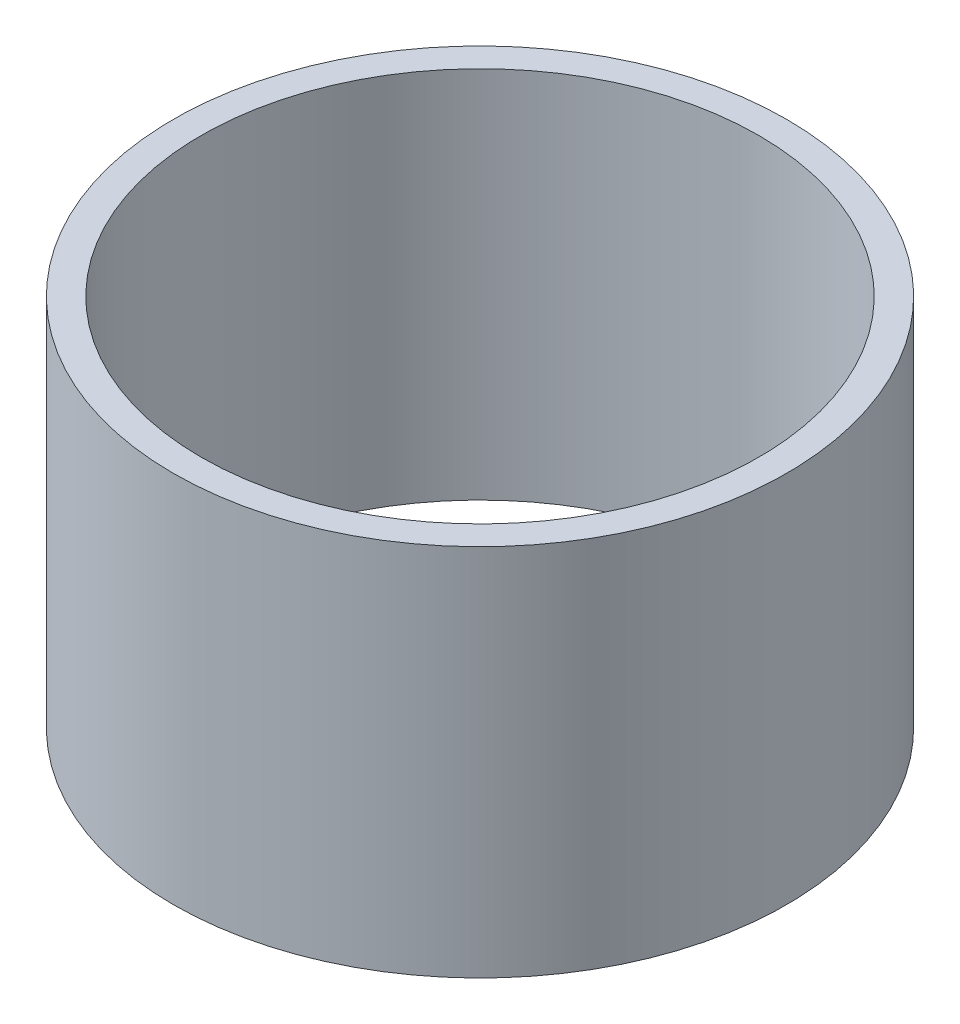
ISO-10303-21;
HEADER;
FILE_DESCRIPTION(('STEP AP214'),'2;1');
FILE_NAME('part.step','',(''),(''),'','','');
FILE_SCHEMA(('AUTOMOTIVE_DESIGN { 1 0 10303 214 1 1 1 1 }'));
ENDSEC;
DATA;
#1=APPLICATION_CONTEXT('core data for automotive mechanical design processes');
#2=APPLICATION_PROTOCOL_DEFINITION('international standard','automotive_design',2000,#1);
#3=PRODUCT_CONTEXT('',#1,'mechanical');
#4=PRODUCT('Part','Part','',(#3));
#5=PRODUCT_RELATED_PRODUCT_CATEGORY('part','',(#4));
#6=PRODUCT_DEFINITION_FORMATION('','',#4);
#7=PRODUCT_DEFINITION_CONTEXT('part definition',#1,'design');
#8=PRODUCT_DEFINITION('design','',#6,#7);
#9=PRODUCT_DEFINITION_SHAPE('','',#8);
#10=(LENGTH_UNIT() NAMED_UNIT(*) SI_UNIT(.MILLI.,.METRE.));
#11=(NAMED_UNIT(*) PLANE_ANGLE_UNIT() SI_UNIT($,.RADIAN.));
#12=(NAMED_UNIT(*) SI_UNIT($,.STERADIAN.) SOLID_ANGLE_UNIT());
#13=UNCERTAINTY_MEASURE_WITH_UNIT(LENGTH_MEASURE(1.E-05),#10,'distance_accuracy_value','');
#14=(GEOMETRIC_REPRESENTATION_CONTEXT(3) GLOBAL_UNCERTAINTY_ASSIGNED_CONTEXT((#13)) GLOBAL_UNIT_ASSIGNED_CONTEXT((#10,
#11,#12)) REPRESENTATION_CONTEXT('',''));
#15=CARTESIAN_POINT('',(0.,0.,0.));
#16=DIRECTION('',(0.,0.,1.));
#17=DIRECTION('',(1.,0.,0.));
#18=AXIS2_PLACEMENT_3D('',#15,#16,#17);
#19=CARTESIAN_POINT('',(0.,67.,0.));
#20=DIRECTION('',(0.,1.,0.));
#21=DIRECTION('',(0.,0.,1.));
#22=AXIS2_PLACEMENT_3D('',#19,#20,#21);
#23=PLANE('',#22);
#24=CARTESIAN_POINT('',(0.,67.,0.));
#25=DIRECTION('',(0.,1.,0.));
#26=DIRECTION('',(0.,0.,1.));
#27=AXIS2_PLACEMENT_3D('',#24,#25,#26);
#28=CIRCLE('',#27,55.);
#29=CARTESIAN_POINT('',(0.,67.,55.));
#30=VERTEX_POINT('',#29);
#31=EDGE_CURVE('E10',#30,#30,#28,.T.);
#32=ORIENTED_EDGE('',*,*,#31,.T.);
#33=EDGE_LOOP('',(#32));
#34=FACE_BOUND('',#33,.T.);
#35=CARTESIAN_POINT('',(0.,67.,0.));
#36=DIRECTION('',(0.,1.,0.));
#37=DIRECTION('',(0.,0.,1.));
#38=AXIS2_PLACEMENT_3D('',#35,#36,#37);
#39=CIRCLE('',#38,50.);
#40=CARTESIAN_POINT('',(0.,67.,50.));
#41=VERTEX_POINT('',#40);
#42=EDGE_CURVE('E43',#41,#41,#39,.T.);
#43=ORIENTED_EDGE('',*,*,#42,.F.);
#44=EDGE_LOOP('',(#43));
#45=FACE_BOUND('',#44,.T.);
#46=ADVANCED_FACE('F32',(#34,#45),#23,.T.);
#47=CARTESIAN_POINT('',(0.,0.,0.));
#48=DIRECTION('',(0.,1.,0.));
#49=DIRECTION('',(0.,0.,1.));
#50=AXIS2_PLACEMENT_3D('',#47,#48,#49);
#51=PLANE('',#50);
#52=CARTESIAN_POINT('',(0.,0.,0.));
#53=DIRECTION('',(0.,1.,0.));
#54=DIRECTION('',(0.,0.,1.));
#55=AXIS2_PLACEMENT_3D('',#52,#53,#54);
#56=CIRCLE('',#55,55.);
#57=CARTESIAN_POINT('',(0.,0.,55.));
#58=VERTEX_POINT('',#57);
#59=EDGE_CURVE('E36',#58,#58,#56,.T.);
#60=ORIENTED_EDGE('',*,*,#59,.F.);
#61=EDGE_LOOP('',(#60));
#62=FACE_BOUND('',#61,.T.);
#63=CARTESIAN_POINT('',(0.,0.,0.));
#64=DIRECTION('',(0.,1.,0.));
#65=DIRECTION('',(0.,0.,1.));
#66=AXIS2_PLACEMENT_3D('',#63,#64,#65);
#67=CIRCLE('',#66,50.);
#68=CARTESIAN_POINT('',(0.,0.,50.));
#69=VERTEX_POINT('',#68);
#70=EDGE_CURVE('E45',#69,#69,#67,.T.);
#71=ORIENTED_EDGE('',*,*,#70,.T.);
#72=EDGE_LOOP('',(#71));
#73=FACE_BOUND('',#72,.T.);
#74=ADVANCED_FACE('F55',(#62,#73),#51,.F.);
#75=CARTESIAN_POINT('',(0.,67.,0.));
#76=DIRECTION('',(0.,-1.,0.));
#77=DIRECTION('',(0.,0.,-1.));
#78=AXIS2_PLACEMENT_3D('',#75,#76,#77);
#79=CYLINDRICAL_SURFACE('',#78,55.);
#80=ORIENTED_EDGE('',*,*,#31,.F.);
#81=EDGE_LOOP('',(#80));
#82=FACE_BOUND('',#81,.T.);
#83=ORIENTED_EDGE('',*,*,#59,.T.);
#84=EDGE_LOOP('',(#83));
#85=FACE_BOUND('',#84,.T.);
#86=ADVANCED_FACE('F34',(#82,#85),#79,.T.);
#87=CARTESIAN_POINT('',(0.,67.,0.));
#88=DIRECTION('',(0.,-1.,0.));
#89=DIRECTION('',(0.,0.,-1.));
#90=AXIS2_PLACEMENT_3D('',#87,#88,#89);
#91=CYLINDRICAL_SURFACE('',#90,50.);
#92=ORIENTED_EDGE('',*,*,#42,.T.);
#93=EDGE_LOOP('',(#92));
#94=FACE_BOUND('',#93,.T.);
#95=ORIENTED_EDGE('',*,*,#70,.F.);
#96=EDGE_LOOP('',(#95));
#97=FACE_BOUND('',#96,.T.);
#98=ADVANCED_FACE('F51',(#94,#97),#91,.F.);
#99=CLOSED_SHELL('',(#46,#74,#86,#98));
#100=MANIFOLD_SOLID_BREP('B2',#99);
#101=ADVANCED_BREP_SHAPE_REPRESENTATION('',(#18,#100),#14);
#102=SHAPE_DEFINITION_REPRESENTATION(#9,#101);
ENDSEC;
END-ISO-10303-21;
